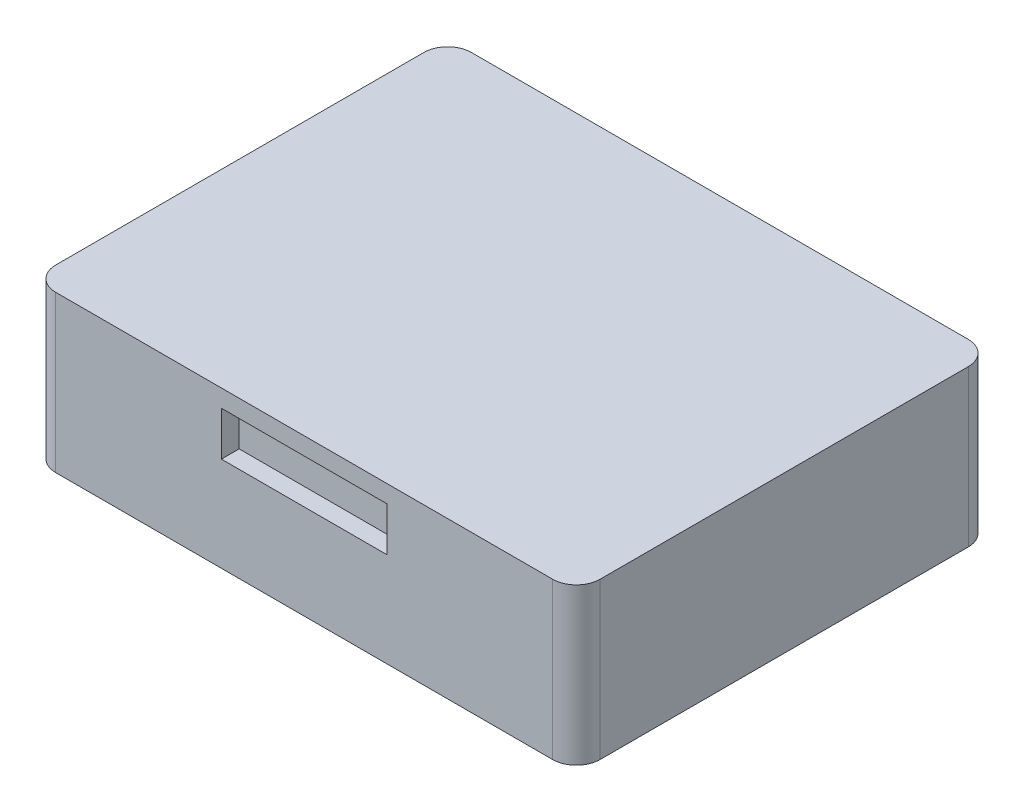
ISO-10303-21;
HEADER;
FILE_DESCRIPTION(('STEP AP214'),'2;1');
FILE_NAME('part.step','',(''),(''),'','','');
FILE_SCHEMA(('AUTOMOTIVE_DESIGN { 1 0 10303 214 1 1 1 1 }'));
ENDSEC;
DATA;
#1=APPLICATION_CONTEXT('core data for automotive mechanical design processes');
#2=APPLICATION_PROTOCOL_DEFINITION('international standard','automotive_design',2000,#1);
#3=PRODUCT_CONTEXT('',#1,'mechanical');
#4=PRODUCT('Part','Part','',(#3));
#5=PRODUCT_RELATED_PRODUCT_CATEGORY('part','',(#4));
#6=PRODUCT_DEFINITION_FORMATION('','',#4);
#7=PRODUCT_DEFINITION_CONTEXT('part definition',#1,'design');
#8=PRODUCT_DEFINITION('design','',#6,#7);
#9=PRODUCT_DEFINITION_SHAPE('','',#8);
#10=(LENGTH_UNIT() NAMED_UNIT(*) SI_UNIT(.MILLI.,.METRE.));
#11=(NAMED_UNIT(*) PLANE_ANGLE_UNIT() SI_UNIT($,.RADIAN.));
#12=(NAMED_UNIT(*) SI_UNIT($,.STERADIAN.) SOLID_ANGLE_UNIT());
#13=UNCERTAINTY_MEASURE_WITH_UNIT(LENGTH_MEASURE(1.E-05),#10,'distance_accuracy_value','');
#14=(GEOMETRIC_REPRESENTATION_CONTEXT(3) GLOBAL_UNCERTAINTY_ASSIGNED_CONTEXT((#13)) GLOBAL_UNIT_ASSIGNED_CONTEXT((#10,
#11,#12)) REPRESENTATION_CONTEXT('',''));
#15=CARTESIAN_POINT('',(0.,0.,0.));
#16=DIRECTION('',(0.,0.,1.));
#17=DIRECTION('',(1.,0.,0.));
#18=AXIS2_PLACEMENT_3D('',#15,#16,#17);
#19=CARTESIAN_POINT('',(-23.,13.2,17.56));
#20=DIRECTION('',(1.,0.,0.));
#21=DIRECTION('',(0.,0.,-1.));
#22=AXIS2_PLACEMENT_3D('',#19,#20,#21);
#23=PLANE('',#22);
#24=DIRECTION('',(0.,0.,1.));
#25=VECTOR('',#24,1.);
#26=CARTESIAN_POINT('',(-23.,13.2,17.56));
#27=LINE('',#26,#25);
#28=CARTESIAN_POINT('',(-23.,13.2,-15.56));
#29=VERTEX_POINT('',#28);
#30=CARTESIAN_POINT('',(-23.,13.2,15.56));
#31=VERTEX_POINT('',#30);
#32=EDGE_CURVE('E323',#29,#31,#27,.T.);
#33=ORIENTED_EDGE('',*,*,#32,.F.);
#34=DIRECTION('',(0.,-1.,0.));
#35=VECTOR('',#34,1.);
#36=CARTESIAN_POINT('',(-23.,13.2,-15.56));
#37=LINE('',#36,#35);
#38=CARTESIAN_POINT('',(-23.,0.,-15.56));
#39=VERTEX_POINT('',#38);
#40=EDGE_CURVE('E354',#29,#39,#37,.T.);
#41=ORIENTED_EDGE('',*,*,#40,.T.);
#42=DIRECTION('',(0.,0.,1.));
#43=VECTOR('',#42,1.);
#44=CARTESIAN_POINT('',(-23.,0.,17.56));
#45=LINE('',#44,#43);
#46=CARTESIAN_POINT('',(-23.,0.,15.56));
#47=VERTEX_POINT('',#46);
#48=EDGE_CURVE('E313',#39,#47,#45,.T.);
#49=ORIENTED_EDGE('',*,*,#48,.T.);
#50=DIRECTION('',(0.,-1.,0.));
#51=VECTOR('',#50,1.);
#52=CARTESIAN_POINT('',(-23.,13.2,15.56));
#53=LINE('',#52,#51);
#54=EDGE_CURVE('E338',#47,#31,#53,.F.);
#55=ORIENTED_EDGE('',*,*,#54,.T.);
#56=EDGE_LOOP('',(#33,#41,#49,#55));
#57=FACE_BOUND('',#56,.T.);
#58=ADVANCED_FACE('F42',(#57),#23,.F.);
#59=CARTESIAN_POINT('',(23.,13.2,17.56));
#60=DIRECTION('',(0.,0.,-1.));
#61=DIRECTION('',(-1.,0.,0.));
#62=AXIS2_PLACEMENT_3D('',#59,#60,#61);
#63=PLANE('',#62);
#64=DIRECTION('',(1.,0.,0.));
#65=VECTOR('',#64,1.);
#66=CARTESIAN_POINT('',(7.,7.99193081106614,17.56));
#67=LINE('',#66,#65);
#68=CARTESIAN_POINT('',(-7.,7.99193081106614,17.56));
#69=VERTEX_POINT('',#68);
#70=CARTESIAN_POINT('',(7.,7.99193081106614,17.56));
#71=VERTEX_POINT('',#70);
#72=EDGE_CURVE('E222',#69,#71,#67,.T.);
#73=ORIENTED_EDGE('',*,*,#72,.F.);
#74=DIRECTION('',(0.,-1.,0.));
#75=VECTOR('',#74,1.);
#76=CARTESIAN_POINT('',(-7.,7.99193081106613,17.56));
#77=LINE('',#76,#75);
#78=CARTESIAN_POINT('',(-7.,11.7179405489725,17.56));
#79=VERTEX_POINT('',#78);
#80=EDGE_CURVE('E189',#79,#69,#77,.T.);
#81=ORIENTED_EDGE('',*,*,#80,.F.);
#82=DIRECTION('',(-1.,0.,0.));
#83=VECTOR('',#82,1.);
#84=CARTESIAN_POINT('',(7.,11.7179405489725,17.56));
#85=LINE('',#84,#83);
#86=CARTESIAN_POINT('',(7.,11.7179405489725,17.56));
#87=VERTEX_POINT('',#86);
#88=EDGE_CURVE('E209',#87,#79,#85,.T.);
#89=ORIENTED_EDGE('',*,*,#88,.F.);
#90=DIRECTION('',(0.,1.,0.));
#91=VECTOR('',#90,1.);
#92=CARTESIAN_POINT('',(7.,7.99193081106614,17.56));
#93=LINE('',#92,#91);
#94=EDGE_CURVE('E213',#71,#87,#93,.T.);
#95=ORIENTED_EDGE('',*,*,#94,.F.);
#96=EDGE_LOOP('',(#73,#81,#89,#95));
#97=FACE_BOUND('',#96,.T.);
#98=DIRECTION('',(1.,0.,0.));
#99=VECTOR('',#98,1.);
#100=CARTESIAN_POINT('',(23.,13.2,17.56));
#101=LINE('',#100,#99);
#102=CARTESIAN_POINT('',(-21.,13.2,17.56));
#103=VERTEX_POINT('',#102);
#104=CARTESIAN_POINT('',(21.,13.2,17.56));
#105=VERTEX_POINT('',#104);
#106=EDGE_CURVE('E327',#103,#105,#101,.T.);
#107=ORIENTED_EDGE('',*,*,#106,.F.);
#108=DIRECTION('',(0.,-1.,0.));
#109=VECTOR('',#108,1.);
#110=CARTESIAN_POINT('',(-21.,13.2,17.56));
#111=LINE('',#110,#109);
#112=CARTESIAN_POINT('',(-21.,0.,17.56));
#113=VERTEX_POINT('',#112);
#114=EDGE_CURVE('E11',#103,#113,#111,.T.);
#115=ORIENTED_EDGE('',*,*,#114,.T.);
#116=DIRECTION('',(1.,0.,0.));
#117=VECTOR('',#116,1.);
#118=CARTESIAN_POINT('',(23.,0.,17.56));
#119=LINE('',#118,#117);
#120=CARTESIAN_POINT('',(21.,0.,17.56));
#121=VERTEX_POINT('',#120);
#122=EDGE_CURVE('E342',#113,#121,#119,.T.);
#123=ORIENTED_EDGE('',*,*,#122,.T.);
#124=DIRECTION('',(0.,-1.,0.));
#125=VECTOR('',#124,1.);
#126=CARTESIAN_POINT('',(21.,13.2,17.56));
#127=LINE('',#126,#125);
#128=EDGE_CURVE('E51',#121,#105,#127,.F.);
#129=ORIENTED_EDGE('',*,*,#128,.T.);
#130=EDGE_LOOP('',(#107,#115,#123,#129));
#131=FACE_BOUND('',#130,.T.);
#132=ADVANCED_FACE('F397',(#97,#131),#63,.F.);
#133=CARTESIAN_POINT('',(23.,13.2,17.56));
#134=DIRECTION('',(-1.,0.,0.));
#135=DIRECTION('',(0.,0.,1.));
#136=AXIS2_PLACEMENT_3D('',#133,#134,#135);
#137=PLANE('',#136);
#138=DIRECTION('',(0.,0.,-1.));
#139=VECTOR('',#138,1.);
#140=CARTESIAN_POINT('',(23.,0.,17.56));
#141=LINE('',#140,#139);
#142=CARTESIAN_POINT('',(23.,0.,15.56));
#143=VERTEX_POINT('',#142);
#144=CARTESIAN_POINT('',(23.,0.,-15.56));
#145=VERTEX_POINT('',#144);
#146=EDGE_CURVE('E346',#143,#145,#141,.T.);
#147=ORIENTED_EDGE('',*,*,#146,.T.);
#148=DIRECTION('',(0.,-1.,0.));
#149=VECTOR('',#148,1.);
#150=CARTESIAN_POINT('',(23.,13.2,-15.56));
#151=LINE('',#150,#149);
#152=CARTESIAN_POINT('',(23.,13.2,-15.56));
#153=VERTEX_POINT('',#152);
#154=EDGE_CURVE('E58',#145,#153,#151,.F.);
#155=ORIENTED_EDGE('',*,*,#154,.T.);
#156=DIRECTION('',(0.,0.,-1.));
#157=VECTOR('',#156,1.);
#158=CARTESIAN_POINT('',(23.,13.2,17.56));
#159=LINE('',#158,#157);
#160=CARTESIAN_POINT('',(23.,13.2,15.56));
#161=VERTEX_POINT('',#160);
#162=EDGE_CURVE('E331',#161,#153,#159,.T.);
#163=ORIENTED_EDGE('',*,*,#162,.F.);
#164=DIRECTION('',(0.,-1.,0.));
#165=VECTOR('',#164,1.);
#166=CARTESIAN_POINT('',(23.,13.2,15.56));
#167=LINE('',#166,#165);
#168=EDGE_CURVE('E388',#161,#143,#167,.T.);
#169=ORIENTED_EDGE('',*,*,#168,.T.);
#170=EDGE_LOOP('',(#147,#155,#163,#169));
#171=FACE_BOUND('',#170,.T.);
#172=ADVANCED_FACE('F405',(#171),#137,.F.);
#173=CARTESIAN_POINT('',(23.,13.2,-17.56));
#174=DIRECTION('',(0.,0.,1.));
#175=DIRECTION('',(1.,0.,0.));
#176=AXIS2_PLACEMENT_3D('',#173,#174,#175);
#177=PLANE('',#176);
#178=DIRECTION('',(1.,0.,0.));
#179=VECTOR('',#178,1.);
#180=CARTESIAN_POINT('',(-17.0711344437733,11.543725802866,-17.56));
#181=LINE('',#180,#179);
#182=CARTESIAN_POINT('',(-17.0711344437733,11.543725802866,-17.56));
#183=VERTEX_POINT('',#182);
#184=CARTESIAN_POINT('',(-3.82113444377328,11.543725802866,-17.56));
#185=VERTEX_POINT('',#184);
#186=EDGE_CURVE('E255',#183,#185,#181,.T.);
#187=ORIENTED_EDGE('',*,*,#186,.F.);
#188=DIRECTION('',(0.,1.,0.));
#189=VECTOR('',#188,1.);
#190=CARTESIAN_POINT('',(-17.0711344437733,6.21372580286597,-17.56));
#191=LINE('',#190,#189);
#192=CARTESIAN_POINT('',(-17.0711344437733,6.21372580286597,-17.56));
#193=VERTEX_POINT('',#192);
#194=EDGE_CURVE('E231',#193,#183,#191,.T.);
#195=ORIENTED_EDGE('',*,*,#194,.F.);
#196=DIRECTION('',(1.,0.,0.));
#197=VECTOR('',#196,1.);
#198=CARTESIAN_POINT('',(-17.0711344437733,6.21372580286597,-17.56));
#199=LINE('',#198,#197);
#200=CARTESIAN_POINT('',(-3.82113444377328,6.21372580286597,-17.56));
#201=VERTEX_POINT('',#200);
#202=EDGE_CURVE('E242',#193,#201,#199,.T.);
#203=ORIENTED_EDGE('',*,*,#202,.T.);
#204=DIRECTION('',(0.,1.,0.));
#205=VECTOR('',#204,1.);
#206=CARTESIAN_POINT('',(-3.82113444377328,6.21372580286597,-17.56));
#207=LINE('',#206,#205);
#208=EDGE_CURVE('E259',#201,#185,#207,.T.);
#209=ORIENTED_EDGE('',*,*,#208,.T.);
#210=EDGE_LOOP('',(#187,#195,#203,#209));
#211=FACE_BOUND('',#210,.T.);
#212=DIRECTION('',(-1.,0.,0.));
#213=VECTOR('',#212,1.);
#214=CARTESIAN_POINT('',(4.32015360510003,6.25898795489292,-17.56));
#215=LINE('',#214,#213);
#216=CARTESIAN_POINT('',(17.5701536051,6.25898795489292,-17.56));
#217=VERTEX_POINT('',#216);
#218=CARTESIAN_POINT('',(4.32015360510003,6.25898795489292,-17.56));
#219=VERTEX_POINT('',#218);
#220=EDGE_CURVE('E299',#217,#219,#215,.T.);
#221=ORIENTED_EDGE('',*,*,#220,.F.);
#222=DIRECTION('',(0.,-1.,0.));
#223=VECTOR('',#222,1.);
#224=CARTESIAN_POINT('',(17.5701536051,6.25898795489292,-17.56));
#225=LINE('',#224,#223);
#226=CARTESIAN_POINT('',(17.5701536051,11.5889879548929,-17.56));
#227=VERTEX_POINT('',#226);
#228=EDGE_CURVE('E269',#227,#217,#225,.T.);
#229=ORIENTED_EDGE('',*,*,#228,.F.);
#230=DIRECTION('',(1.,0.,0.));
#231=VECTOR('',#230,1.);
#232=CARTESIAN_POINT('',(4.32015360510003,11.5889879548929,-17.56));
#233=LINE('',#232,#231);
#234=CARTESIAN_POINT('',(4.32015360510003,11.5889879548929,-17.56));
#235=VERTEX_POINT('',#234);
#236=EDGE_CURVE('E284',#235,#227,#233,.T.);
#237=ORIENTED_EDGE('',*,*,#236,.F.);
#238=DIRECTION('',(0.,1.,0.));
#239=VECTOR('',#238,1.);
#240=CARTESIAN_POINT('',(4.32015360510003,6.25898795489292,-17.56));
#241=LINE('',#240,#239);
#242=EDGE_CURVE('E303',#219,#235,#241,.T.);
#243=ORIENTED_EDGE('',*,*,#242,.F.);
#244=EDGE_LOOP('',(#221,#229,#237,#243));
#245=FACE_BOUND('',#244,.T.);
#246=DIRECTION('',(-1.,0.,0.));
#247=VECTOR('',#246,1.);
#248=CARTESIAN_POINT('',(23.,0.,-17.56));
#249=LINE('',#248,#247);
#250=CARTESIAN_POINT('',(21.,0.,-17.56));
#251=VERTEX_POINT('',#250);
#252=CARTESIAN_POINT('',(-21.,0.,-17.56));
#253=VERTEX_POINT('',#252);
#254=EDGE_CURVE('E328',#251,#253,#249,.T.);
#255=ORIENTED_EDGE('',*,*,#254,.T.);
#256=DIRECTION('',(0.,-1.,0.));
#257=VECTOR('',#256,1.);
#258=CARTESIAN_POINT('',(-21.,13.2,-17.56));
#259=LINE('',#258,#257);
#260=CARTESIAN_POINT('',(-21.,13.2,-17.56));
#261=VERTEX_POINT('',#260);
#262=EDGE_CURVE('E374',#253,#261,#259,.F.);
#263=ORIENTED_EDGE('',*,*,#262,.T.);
#264=DIRECTION('',(-1.,0.,0.));
#265=VECTOR('',#264,1.);
#266=CARTESIAN_POINT('',(23.,13.2,-17.56));
#267=LINE('',#266,#265);
#268=CARTESIAN_POINT('',(21.,13.2,-17.56));
#269=VERTEX_POINT('',#268);
#270=EDGE_CURVE('E334',#269,#261,#267,.T.);
#271=ORIENTED_EDGE('',*,*,#270,.F.);
#272=DIRECTION('',(0.,-1.,0.));
#273=VECTOR('',#272,1.);
#274=CARTESIAN_POINT('',(21.,13.2,-17.56));
#275=LINE('',#274,#273);
#276=EDGE_CURVE('E370',#269,#251,#275,.T.);
#277=ORIENTED_EDGE('',*,*,#276,.T.);
#278=EDGE_LOOP('',(#255,#263,#271,#277));
#279=FACE_BOUND('',#278,.T.);
#280=ADVANCED_FACE('F416',(#211,#245,#279),#177,.F.);
#281=CARTESIAN_POINT('',(0.,13.2,0.));
#282=DIRECTION('',(0.,1.,0.));
#283=DIRECTION('',(0.,0.,1.));
#284=AXIS2_PLACEMENT_3D('',#281,#282,#283);
#285=PLANE('',#284);
#286=ORIENTED_EDGE('',*,*,#270,.T.);
#287=CARTESIAN_POINT('',(-21.,13.2,-15.56));
#288=DIRECTION('',(0.,1.,0.));
#289=DIRECTION('',(0.,0.,1.));
#290=AXIS2_PLACEMENT_3D('',#287,#288,#289);
#291=CIRCLE('',#290,2.);
#292=EDGE_CURVE('E385',#261,#29,#291,.T.);
#293=ORIENTED_EDGE('',*,*,#292,.T.);
#294=ORIENTED_EDGE('',*,*,#32,.T.);
#295=CARTESIAN_POINT('',(-21.,13.2,15.56));
#296=DIRECTION('',(0.,1.,0.));
#297=DIRECTION('',(0.,0.,1.));
#298=AXIS2_PLACEMENT_3D('',#295,#296,#297);
#299=CIRCLE('',#298,2.);
#300=EDGE_CURVE('E379',#31,#103,#299,.T.);
#301=ORIENTED_EDGE('',*,*,#300,.T.);
#302=ORIENTED_EDGE('',*,*,#106,.T.);
#303=CARTESIAN_POINT('',(21.,13.2,15.56));
#304=DIRECTION('',(0.,1.,0.));
#305=DIRECTION('',(0.,0.,1.));
#306=AXIS2_PLACEMENT_3D('',#303,#304,#305);
#307=CIRCLE('',#306,2.);
#308=EDGE_CURVE('E65',#105,#161,#307,.T.);
#309=ORIENTED_EDGE('',*,*,#308,.T.);
#310=ORIENTED_EDGE('',*,*,#162,.T.);
#311=CARTESIAN_POINT('',(21.,13.2,-15.56));
#312=DIRECTION('',(0.,1.,0.));
#313=DIRECTION('',(0.,0.,1.));
#314=AXIS2_PLACEMENT_3D('',#311,#312,#313);
#315=CIRCLE('',#314,2.);
#316=EDGE_CURVE('E382',#153,#269,#315,.T.);
#317=ORIENTED_EDGE('',*,*,#316,.T.);
#318=EDGE_LOOP('',(#286,#293,#294,#301,#302,#309,#310,#317));
#319=FACE_BOUND('',#318,.T.);
#320=ADVANCED_FACE('F401',(#319),#285,.T.);
#321=CARTESIAN_POINT('',(0.,0.,0.));
#322=DIRECTION('',(0.,1.,0.));
#323=DIRECTION('',(0.,0.,1.));
#324=AXIS2_PLACEMENT_3D('',#321,#322,#323);
#325=PLANE('',#324);
#326=ORIENTED_EDGE('',*,*,#48,.F.);
#327=CARTESIAN_POINT('',(-21.,0.,-15.56));
#328=DIRECTION('',(0.,1.,0.));
#329=DIRECTION('',(0.,0.,1.));
#330=AXIS2_PLACEMENT_3D('',#327,#328,#329);
#331=CIRCLE('',#330,2.);
#332=EDGE_CURVE('E367',#39,#253,#331,.F.);
#333=ORIENTED_EDGE('',*,*,#332,.T.);
#334=ORIENTED_EDGE('',*,*,#254,.F.);
#335=CARTESIAN_POINT('',(21.,0.,-15.56));
#336=DIRECTION('',(0.,1.,0.));
#337=DIRECTION('',(0.,0.,1.));
#338=AXIS2_PLACEMENT_3D('',#335,#336,#337);
#339=CIRCLE('',#338,2.);
#340=EDGE_CURVE('E364',#251,#145,#339,.F.);
#341=ORIENTED_EDGE('',*,*,#340,.T.);
#342=ORIENTED_EDGE('',*,*,#146,.F.);
#343=CARTESIAN_POINT('',(21.,0.,15.56));
#344=DIRECTION('',(0.,1.,0.));
#345=DIRECTION('',(0.,0.,1.));
#346=AXIS2_PLACEMENT_3D('',#343,#344,#345);
#347=CIRCLE('',#346,2.);
#348=EDGE_CURVE('E358',#143,#121,#347,.F.);
#349=ORIENTED_EDGE('',*,*,#348,.T.);
#350=ORIENTED_EDGE('',*,*,#122,.F.);
#351=CARTESIAN_POINT('',(-21.,0.,15.56));
#352=DIRECTION('',(0.,1.,0.));
#353=DIRECTION('',(0.,0.,1.));
#354=AXIS2_PLACEMENT_3D('',#351,#352,#353);
#355=CIRCLE('',#354,2.);
#356=EDGE_CURVE('E361',#113,#47,#355,.F.);
#357=ORIENTED_EDGE('',*,*,#356,.T.);
#358=EDGE_LOOP('',(#326,#333,#334,#341,#342,#349,#350,#357));
#359=FACE_BOUND('',#358,.T.);
#360=ADVANCED_FACE('F408',(#359),#325,.F.);
#361=CARTESIAN_POINT('',(17.5701536051,6.25898795489292,-16.06));
#362=DIRECTION('',(1.,0.,0.));
#363=DIRECTION('',(0.,0.,-1.));
#364=AXIS2_PLACEMENT_3D('',#361,#362,#363);
#365=PLANE('',#364);
#366=ORIENTED_EDGE('',*,*,#228,.T.);
#367=DIRECTION('',(0.,0.,-1.));
#368=VECTOR('',#367,1.);
#369=CARTESIAN_POINT('',(17.5701536051,6.25898795489292,-16.06));
#370=LINE('',#369,#368);
#371=CARTESIAN_POINT('',(17.5701536051,6.25898795489292,-16.06));
#372=VERTEX_POINT('',#371);
#373=EDGE_CURVE('E296',#372,#217,#370,.T.);
#374=ORIENTED_EDGE('',*,*,#373,.F.);
#375=DIRECTION('',(0.,-1.,0.));
#376=VECTOR('',#375,1.);
#377=CARTESIAN_POINT('',(17.5701536051,6.25898795489292,-16.06));
#378=LINE('',#377,#376);
#379=CARTESIAN_POINT('',(17.5701536051,11.5889879548929,-16.06));
#380=VERTEX_POINT('',#379);
#381=EDGE_CURVE('E279',#380,#372,#378,.T.);
#382=ORIENTED_EDGE('',*,*,#381,.F.);
#383=DIRECTION('',(0.,0.,-1.));
#384=VECTOR('',#383,1.);
#385=CARTESIAN_POINT('',(17.5701536051,11.5889879548929,-16.06));
#386=LINE('',#385,#384);
#387=EDGE_CURVE('E310',#380,#227,#386,.T.);
#388=ORIENTED_EDGE('',*,*,#387,.T.);
#389=EDGE_LOOP('',(#366,#374,#382,#388));
#390=FACE_BOUND('',#389,.T.);
#391=ADVANCED_FACE('F491',(#390),#365,.F.);
#392=CARTESIAN_POINT('',(4.32015360510003,11.5889879548929,-16.06));
#393=DIRECTION('',(0.,1.,0.));
#394=DIRECTION('',(-1.,0.,0.));
#395=AXIS2_PLACEMENT_3D('',#392,#393,#394);
#396=PLANE('',#395);
#397=ORIENTED_EDGE('',*,*,#236,.T.);
#398=ORIENTED_EDGE('',*,*,#387,.F.);
#399=DIRECTION('',(1.,0.,0.));
#400=VECTOR('',#399,1.);
#401=CARTESIAN_POINT('',(4.32015360510003,11.5889879548929,-16.06));
#402=LINE('',#401,#400);
#403=CARTESIAN_POINT('',(4.32015360510003,11.5889879548929,-16.06));
#404=VERTEX_POINT('',#403);
#405=EDGE_CURVE('E292',#404,#380,#402,.T.);
#406=ORIENTED_EDGE('',*,*,#405,.F.);
#407=DIRECTION('',(0.,0.,-1.));
#408=VECTOR('',#407,1.);
#409=CARTESIAN_POINT('',(4.32015360510003,11.5889879548929,-16.06));
#410=LINE('',#409,#408);
#411=EDGE_CURVE('E314',#404,#235,#410,.T.);
#412=ORIENTED_EDGE('',*,*,#411,.T.);
#413=EDGE_LOOP('',(#397,#398,#406,#412));
#414=FACE_BOUND('',#413,.T.);
#415=ADVANCED_FACE('F487',(#414),#396,.F.);
#416=CARTESIAN_POINT('',(4.32015360510003,6.25898795489292,-16.06));
#417=DIRECTION('',(-1.,0.,0.));
#418=DIRECTION('',(0.,-1.,0.));
#419=AXIS2_PLACEMENT_3D('',#416,#417,#418);
#420=PLANE('',#419);
#421=ORIENTED_EDGE('',*,*,#242,.T.);
#422=ORIENTED_EDGE('',*,*,#411,.F.);
#423=DIRECTION('',(0.,1.,0.));
#424=VECTOR('',#423,1.);
#425=CARTESIAN_POINT('',(4.32015360510003,6.25898795489292,-16.06));
#426=LINE('',#425,#424);
#427=CARTESIAN_POINT('',(4.32015360510003,6.25898795489292,-16.06));
#428=VERTEX_POINT('',#427);
#429=EDGE_CURVE('E288',#428,#404,#426,.T.);
#430=ORIENTED_EDGE('',*,*,#429,.F.);
#431=DIRECTION('',(0.,0.,-1.));
#432=VECTOR('',#431,1.);
#433=CARTESIAN_POINT('',(4.32015360510003,6.25898795489292,-16.06));
#434=LINE('',#433,#432);
#435=EDGE_CURVE('E317',#428,#219,#434,.T.);
#436=ORIENTED_EDGE('',*,*,#435,.T.);
#437=EDGE_LOOP('',(#421,#422,#430,#436));
#438=FACE_BOUND('',#437,.T.);
#439=ADVANCED_FACE('F490',(#438),#420,.F.);
#440=CARTESIAN_POINT('',(4.32015360510003,6.25898795489292,-16.06));
#441=DIRECTION('',(0.,-1.,0.));
#442=DIRECTION('',(1.,0.,0.));
#443=AXIS2_PLACEMENT_3D('',#440,#441,#442);
#444=PLANE('',#443);
#445=ORIENTED_EDGE('',*,*,#220,.T.);
#446=ORIENTED_EDGE('',*,*,#435,.F.);
#447=DIRECTION('',(-1.,0.,0.));
#448=VECTOR('',#447,1.);
#449=CARTESIAN_POINT('',(4.32015360510003,6.25898795489292,-16.06));
#450=LINE('',#449,#448);
#451=EDGE_CURVE('E283',#372,#428,#450,.T.);
#452=ORIENTED_EDGE('',*,*,#451,.F.);
#453=ORIENTED_EDGE('',*,*,#373,.T.);
#454=EDGE_LOOP('',(#445,#446,#452,#453));
#455=FACE_BOUND('',#454,.T.);
#456=ADVANCED_FACE('F485',(#455),#444,.F.);
#457=CARTESIAN_POINT('',(0.,0.,-16.06));
#458=DIRECTION('',(0.,0.,-1.));
#459=DIRECTION('',(-1.,0.,0.));
#460=AXIS2_PLACEMENT_3D('',#457,#458,#459);
#461=PLANE('',#460);
#462=ORIENTED_EDGE('',*,*,#381,.T.);
#463=ORIENTED_EDGE('',*,*,#451,.T.);
#464=ORIENTED_EDGE('',*,*,#429,.T.);
#465=ORIENTED_EDGE('',*,*,#405,.T.);
#466=EDGE_LOOP('',(#462,#463,#464,#465));
#467=FACE_BOUND('',#466,.T.);
#468=ADVANCED_FACE('F481',(#467),#461,.T.);
#469=CARTESIAN_POINT('',(-17.0711344437733,6.21372580286597,-16.06));
#470=DIRECTION('',(-1.,0.,0.));
#471=DIRECTION('',(0.,0.,1.));
#472=AXIS2_PLACEMENT_3D('',#469,#470,#471);
#473=PLANE('',#472);
#474=ORIENTED_EDGE('',*,*,#194,.T.);
#475=DIRECTION('',(0.,0.,-1.));
#476=VECTOR('',#475,1.);
#477=CARTESIAN_POINT('',(-17.0711344437733,11.543725802866,-16.06));
#478=LINE('',#477,#476);
#479=CARTESIAN_POINT('',(-17.0711344437733,11.543725802866,-16.06));
#480=VERTEX_POINT('',#479);
#481=EDGE_CURVE('E252',#480,#183,#478,.T.);
#482=ORIENTED_EDGE('',*,*,#481,.F.);
#483=DIRECTION('',(0.,1.,0.));
#484=VECTOR('',#483,1.);
#485=CARTESIAN_POINT('',(-17.0711344437733,6.21372580286597,-16.06));
#486=LINE('',#485,#484);
#487=CARTESIAN_POINT('',(-17.0711344437733,6.21372580286597,-16.06));
#488=VERTEX_POINT('',#487);
#489=EDGE_CURVE('E237',#488,#480,#486,.T.);
#490=ORIENTED_EDGE('',*,*,#489,.F.);
#491=DIRECTION('',(0.,0.,-1.));
#492=VECTOR('',#491,1.);
#493=CARTESIAN_POINT('',(-17.0711344437733,6.21372580286597,-16.06));
#494=LINE('',#493,#492);
#495=EDGE_CURVE('E266',#488,#193,#494,.T.);
#496=ORIENTED_EDGE('',*,*,#495,.T.);
#497=EDGE_LOOP('',(#474,#482,#490,#496));
#498=FACE_BOUND('',#497,.T.);
#499=ADVANCED_FACE('F471',(#498),#473,.F.);
#500=CARTESIAN_POINT('',(-17.0711344437733,6.21372580286597,-16.06));
#501=DIRECTION('',(0.,1.,0.));
#502=DIRECTION('',(-1.,0.,0.));
#503=AXIS2_PLACEMENT_3D('',#500,#501,#502);
#504=PLANE('',#503);
#505=ORIENTED_EDGE('',*,*,#202,.F.);
#506=ORIENTED_EDGE('',*,*,#495,.F.);
#507=DIRECTION('',(1.,0.,0.));
#508=VECTOR('',#507,1.);
#509=CARTESIAN_POINT('',(-17.0711344437733,6.21372580286597,-16.06));
#510=LINE('',#509,#508);
#511=CARTESIAN_POINT('',(-3.82113444377328,6.21372580286597,-16.06));
#512=VERTEX_POINT('',#511);
#513=EDGE_CURVE('E249',#488,#512,#510,.T.);
#514=ORIENTED_EDGE('',*,*,#513,.T.);
#515=DIRECTION('',(0.,0.,-1.));
#516=VECTOR('',#515,1.);
#517=CARTESIAN_POINT('',(-3.82113444377328,6.21372580286597,-16.06));
#518=LINE('',#517,#516);
#519=EDGE_CURVE('E270',#512,#201,#518,.T.);
#520=ORIENTED_EDGE('',*,*,#519,.T.);
#521=EDGE_LOOP('',(#505,#506,#514,#520));
#522=FACE_BOUND('',#521,.T.);
#523=ADVANCED_FACE('F467',(#522),#504,.T.);
#524=CARTESIAN_POINT('',(-3.82113444377328,6.21372580286597,-16.06));
#525=DIRECTION('',(-1.,0.,0.));
#526=DIRECTION('',(0.,0.,1.));
#527=AXIS2_PLACEMENT_3D('',#524,#525,#526);
#528=PLANE('',#527);
#529=ORIENTED_EDGE('',*,*,#208,.F.);
#530=ORIENTED_EDGE('',*,*,#519,.F.);
#531=DIRECTION('',(0.,1.,0.));
#532=VECTOR('',#531,1.);
#533=CARTESIAN_POINT('',(-3.82113444377328,6.21372580286597,-16.06));
#534=LINE('',#533,#532);
#535=CARTESIAN_POINT('',(-3.82113444377328,11.543725802866,-16.06));
#536=VERTEX_POINT('',#535);
#537=EDGE_CURVE('E246',#512,#536,#534,.T.);
#538=ORIENTED_EDGE('',*,*,#537,.T.);
#539=DIRECTION('',(0.,0.,-1.));
#540=VECTOR('',#539,1.);
#541=CARTESIAN_POINT('',(-3.82113444377328,11.543725802866,-16.06));
#542=LINE('',#541,#540);
#543=EDGE_CURVE('E273',#536,#185,#542,.T.);
#544=ORIENTED_EDGE('',*,*,#543,.T.);
#545=EDGE_LOOP('',(#529,#530,#538,#544));
#546=FACE_BOUND('',#545,.T.);
#547=ADVANCED_FACE('F470',(#546),#528,.T.);
#548=CARTESIAN_POINT('',(-17.0711344437733,11.543725802866,-16.06));
#549=DIRECTION('',(0.,1.,0.));
#550=DIRECTION('',(0.,0.,1.));
#551=AXIS2_PLACEMENT_3D('',#548,#549,#550);
#552=PLANE('',#551);
#553=ORIENTED_EDGE('',*,*,#186,.T.);
#554=ORIENTED_EDGE('',*,*,#543,.F.);
#555=DIRECTION('',(1.,0.,0.));
#556=VECTOR('',#555,1.);
#557=CARTESIAN_POINT('',(-17.0711344437733,11.543725802866,-16.06));
#558=LINE('',#557,#556);
#559=EDGE_CURVE('E241',#480,#536,#558,.T.);
#560=ORIENTED_EDGE('',*,*,#559,.F.);
#561=ORIENTED_EDGE('',*,*,#481,.T.);
#562=EDGE_LOOP('',(#553,#554,#560,#561));
#563=FACE_BOUND('',#562,.T.);
#564=ADVANCED_FACE('F465',(#563),#552,.F.);
#565=CARTESIAN_POINT('',(0.,0.,-16.06));
#566=DIRECTION('',(0.,0.,-1.));
#567=DIRECTION('',(-1.,0.,0.));
#568=AXIS2_PLACEMENT_3D('',#565,#566,#567);
#569=PLANE('',#568);
#570=ORIENTED_EDGE('',*,*,#489,.T.);
#571=ORIENTED_EDGE('',*,*,#559,.T.);
#572=ORIENTED_EDGE('',*,*,#537,.F.);
#573=ORIENTED_EDGE('',*,*,#513,.F.);
#574=EDGE_LOOP('',(#570,#571,#572,#573));
#575=FACE_BOUND('',#574,.T.);
#576=ADVANCED_FACE('F462',(#575),#569,.T.);
#577=CARTESIAN_POINT('',(-7.,7.99193081106613,16.06));
#578=DIRECTION('',(-1.,0.,0.));
#579=DIRECTION('',(0.,0.,1.));
#580=AXIS2_PLACEMENT_3D('',#577,#578,#579);
#581=PLANE('',#580);
#582=ORIENTED_EDGE('',*,*,#80,.T.);
#583=DIRECTION('',(0.,0.,1.));
#584=VECTOR('',#583,1.);
#585=CARTESIAN_POINT('',(-7.,7.99193081106613,16.06));
#586=LINE('',#585,#584);
#587=CARTESIAN_POINT('',(-7.,7.99193081106613,16.06));
#588=VERTEX_POINT('',#587);
#589=EDGE_CURVE('E182',#588,#69,#586,.T.);
#590=ORIENTED_EDGE('',*,*,#589,.F.);
#591=DIRECTION('',(0.,-1.,0.));
#592=VECTOR('',#591,1.);
#593=CARTESIAN_POINT('',(-7.,7.99193081106613,16.06));
#594=LINE('',#593,#592);
#595=CARTESIAN_POINT('',(-7.,11.7179405489725,16.06));
#596=VERTEX_POINT('',#595);
#597=EDGE_CURVE('E186',#596,#588,#594,.T.);
#598=ORIENTED_EDGE('',*,*,#597,.F.);
#599=DIRECTION('',(0.,0.,1.));
#600=VECTOR('',#599,1.);
#601=CARTESIAN_POINT('',(-7.,11.7179405489725,16.06));
#602=LINE('',#601,#600);
#603=EDGE_CURVE('E228',#596,#79,#602,.T.);
#604=ORIENTED_EDGE('',*,*,#603,.T.);
#605=EDGE_LOOP('',(#582,#590,#598,#604));
#606=FACE_BOUND('',#605,.T.);
#607=ADVANCED_FACE('F184',(#606),#581,.F.);
#608=CARTESIAN_POINT('',(7.,11.7179405489725,16.06));
#609=DIRECTION('',(0.,1.,0.));
#610=DIRECTION('',(-1.,0.,0.));
#611=AXIS2_PLACEMENT_3D('',#608,#609,#610);
#612=PLANE('',#611);
#613=ORIENTED_EDGE('',*,*,#88,.T.);
#614=ORIENTED_EDGE('',*,*,#603,.F.);
#615=DIRECTION('',(-1.,0.,0.));
#616=VECTOR('',#615,1.);
#617=CARTESIAN_POINT('',(7.,11.7179405489725,16.06));
#618=LINE('',#617,#616);
#619=CARTESIAN_POINT('',(7.,11.7179405489725,16.06));
#620=VERTEX_POINT('',#619);
#621=EDGE_CURVE('E195',#620,#596,#618,.T.);
#622=ORIENTED_EDGE('',*,*,#621,.F.);
#623=DIRECTION('',(0.,0.,1.));
#624=VECTOR('',#623,1.);
#625=CARTESIAN_POINT('',(7.,11.7179405489725,16.06));
#626=LINE('',#625,#624);
#627=EDGE_CURVE('E232',#620,#87,#626,.T.);
#628=ORIENTED_EDGE('',*,*,#627,.T.);
#629=EDGE_LOOP('',(#613,#614,#622,#628));
#630=FACE_BOUND('',#629,.T.);
#631=ADVANCED_FACE('F453',(#630),#612,.F.);
#632=CARTESIAN_POINT('',(7.,7.99193081106614,16.06));
#633=DIRECTION('',(1.,0.,0.));
#634=DIRECTION('',(0.,0.,-1.));
#635=AXIS2_PLACEMENT_3D('',#632,#633,#634);
#636=PLANE('',#635);
#637=ORIENTED_EDGE('',*,*,#94,.T.);
#638=ORIENTED_EDGE('',*,*,#627,.F.);
#639=DIRECTION('',(0.,1.,0.));
#640=VECTOR('',#639,1.);
#641=CARTESIAN_POINT('',(7.,7.99193081106614,16.06));
#642=LINE('',#641,#640);
#643=CARTESIAN_POINT('',(7.,7.99193081106614,16.06));
#644=VERTEX_POINT('',#643);
#645=EDGE_CURVE('E204',#644,#620,#642,.T.);
#646=ORIENTED_EDGE('',*,*,#645,.F.);
#647=DIRECTION('',(0.,0.,1.));
#648=VECTOR('',#647,1.);
#649=CARTESIAN_POINT('',(7.,7.99193081106614,16.06));
#650=LINE('',#649,#648);
#651=EDGE_CURVE('E194',#644,#71,#650,.T.);
#652=ORIENTED_EDGE('',*,*,#651,.T.);
#653=EDGE_LOOP('',(#637,#638,#646,#652));
#654=FACE_BOUND('',#653,.T.);
#655=ADVANCED_FACE('F450',(#654),#636,.F.);
#656=CARTESIAN_POINT('',(7.,7.99193081106614,16.06));
#657=DIRECTION('',(0.,-1.,0.));
#658=DIRECTION('',(1.,0.,0.));
#659=AXIS2_PLACEMENT_3D('',#656,#657,#658);
#660=PLANE('',#659);
#661=ORIENTED_EDGE('',*,*,#72,.T.);
#662=ORIENTED_EDGE('',*,*,#651,.F.);
#663=DIRECTION('',(1.,0.,0.));
#664=VECTOR('',#663,1.);
#665=CARTESIAN_POINT('',(7.,7.99193081106614,16.06));
#666=LINE('',#665,#664);
#667=EDGE_CURVE('E198',#588,#644,#666,.T.);
#668=ORIENTED_EDGE('',*,*,#667,.F.);
#669=ORIENTED_EDGE('',*,*,#589,.T.);
#670=EDGE_LOOP('',(#661,#662,#668,#669));
#671=FACE_BOUND('',#670,.T.);
#672=ADVANCED_FACE('F199',(#671),#660,.F.);
#673=CARTESIAN_POINT('',(0.,0.,16.06));
#674=DIRECTION('',(0.,0.,1.));
#675=DIRECTION('',(1.,0.,0.));
#676=AXIS2_PLACEMENT_3D('',#673,#674,#675);
#677=PLANE('',#676);
#678=ORIENTED_EDGE('',*,*,#597,.T.);
#679=ORIENTED_EDGE('',*,*,#667,.T.);
#680=ORIENTED_EDGE('',*,*,#645,.T.);
#681=ORIENTED_EDGE('',*,*,#621,.T.);
#682=EDGE_LOOP('',(#678,#679,#680,#681));
#683=FACE_BOUND('',#682,.T.);
#684=ADVANCED_FACE('F206',(#683),#677,.T.);
#685=CARTESIAN_POINT('',(-21.,13.2,-15.56));
#686=DIRECTION('',(0.,-1.,0.));
#687=DIRECTION('',(0.,0.,-1.));
#688=AXIS2_PLACEMENT_3D('',#685,#686,#687);
#689=CYLINDRICAL_SURFACE('',#688,2.);
#690=ORIENTED_EDGE('',*,*,#292,.F.);
#691=ORIENTED_EDGE('',*,*,#262,.F.);
#692=ORIENTED_EDGE('',*,*,#332,.F.);
#693=ORIENTED_EDGE('',*,*,#40,.F.);
#694=EDGE_LOOP('',(#690,#691,#692,#693));
#695=FACE_BOUND('',#694,.T.);
#696=ADVANCED_FACE('F422',(#695),#689,.T.);
#697=CARTESIAN_POINT('',(21.,13.2,-15.56));
#698=DIRECTION('',(0.,-1.,0.));
#699=DIRECTION('',(0.,0.,-1.));
#700=AXIS2_PLACEMENT_3D('',#697,#698,#699);
#701=CYLINDRICAL_SURFACE('',#700,2.);
#702=ORIENTED_EDGE('',*,*,#316,.F.);
#703=ORIENTED_EDGE('',*,*,#154,.F.);
#704=ORIENTED_EDGE('',*,*,#340,.F.);
#705=ORIENTED_EDGE('',*,*,#276,.F.);
#706=EDGE_LOOP('',(#702,#703,#704,#705));
#707=FACE_BOUND('',#706,.T.);
#708=ADVANCED_FACE('F413',(#707),#701,.T.);
#709=CARTESIAN_POINT('',(-21.,13.2,15.56));
#710=DIRECTION('',(0.,-1.,0.));
#711=DIRECTION('',(0.,0.,-1.));
#712=AXIS2_PLACEMENT_3D('',#709,#710,#711);
#713=CYLINDRICAL_SURFACE('',#712,2.);
#714=ORIENTED_EDGE('',*,*,#300,.F.);
#715=ORIENTED_EDGE('',*,*,#54,.F.);
#716=ORIENTED_EDGE('',*,*,#356,.F.);
#717=ORIENTED_EDGE('',*,*,#114,.F.);
#718=EDGE_LOOP('',(#714,#715,#716,#717));
#719=FACE_BOUND('',#718,.T.);
#720=ADVANCED_FACE('F426',(#719),#713,.T.);
#721=CARTESIAN_POINT('',(21.,13.2,15.56));
#722=DIRECTION('',(0.,-1.,0.));
#723=DIRECTION('',(0.,0.,-1.));
#724=AXIS2_PLACEMENT_3D('',#721,#722,#723);
#725=CYLINDRICAL_SURFACE('',#724,2.);
#726=ORIENTED_EDGE('',*,*,#308,.F.);
#727=ORIENTED_EDGE('',*,*,#128,.F.);
#728=ORIENTED_EDGE('',*,*,#348,.F.);
#729=ORIENTED_EDGE('',*,*,#168,.F.);
#730=EDGE_LOOP('',(#726,#727,#728,#729));
#731=FACE_BOUND('',#730,.T.);
#732=ADVANCED_FACE('F44',(#731),#725,.T.);
#733=CLOSED_SHELL('',(#58,#132,#172,#280,#320,#360,#391,#415,#439,#456,#468,#499,#523,#547,#564,
#576,#607,#631,#655,#672,#684,#696,#708,#720,#732));
#734=MANIFOLD_SOLID_BREP('B2',#733);
#735=ADVANCED_BREP_SHAPE_REPRESENTATION('',(#18,#734),#14);
#736=SHAPE_DEFINITION_REPRESENTATION(#9,#735);
ENDSEC;
END-ISO-10303-21;
